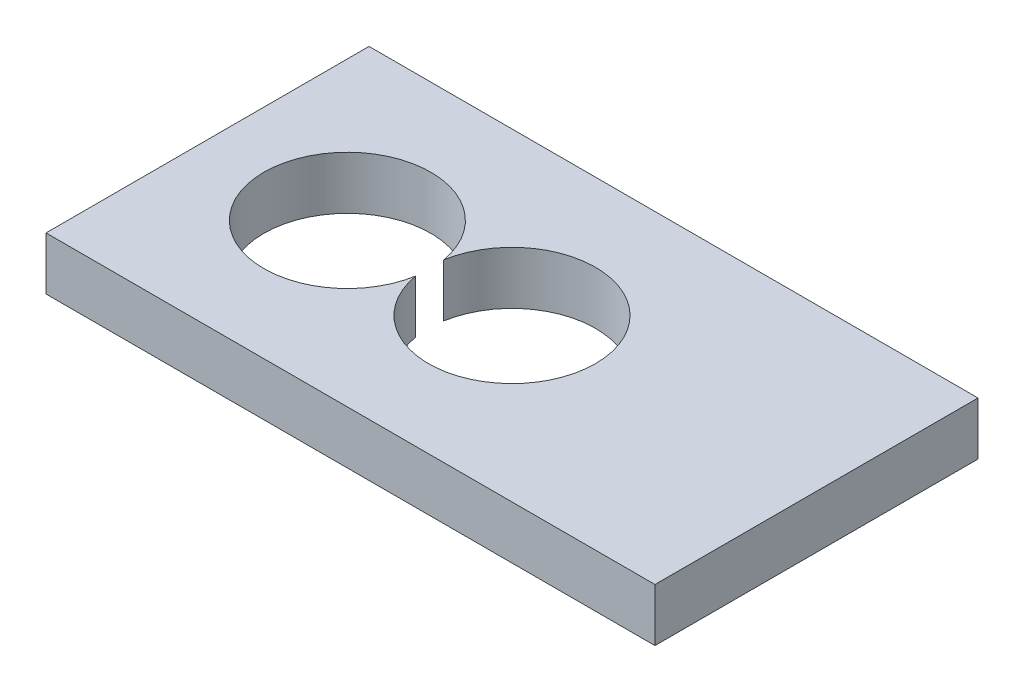
ISO-10303-21;
HEADER;
FILE_DESCRIPTION(('STEP AP214'),'2;1');
FILE_NAME('part.step','',(''),(''),'','','');
FILE_SCHEMA(('AUTOMOTIVE_DESIGN { 1 0 10303 214 1 1 1 1 }'));
ENDSEC;
DATA;
#1=APPLICATION_CONTEXT('core data for automotive mechanical design processes');
#2=APPLICATION_PROTOCOL_DEFINITION('international standard','automotive_design',2000,#1);
#3=PRODUCT_CONTEXT('',#1,'mechanical');
#4=PRODUCT('Part','Part','',(#3));
#5=PRODUCT_RELATED_PRODUCT_CATEGORY('part','',(#4));
#6=PRODUCT_DEFINITION_FORMATION('','',#4);
#7=PRODUCT_DEFINITION_CONTEXT('part definition',#1,'design');
#8=PRODUCT_DEFINITION('design','',#6,#7);
#9=PRODUCT_DEFINITION_SHAPE('','',#8);
#10=(LENGTH_UNIT() NAMED_UNIT(*) SI_UNIT(.MILLI.,.METRE.));
#11=(NAMED_UNIT(*) PLANE_ANGLE_UNIT() SI_UNIT($,.RADIAN.));
#12=(NAMED_UNIT(*) SI_UNIT($,.STERADIAN.) SOLID_ANGLE_UNIT());
#13=UNCERTAINTY_MEASURE_WITH_UNIT(LENGTH_MEASURE(1.E-05),#10,'distance_accuracy_value','');
#14=(GEOMETRIC_REPRESENTATION_CONTEXT(3) GLOBAL_UNCERTAINTY_ASSIGNED_CONTEXT((#13)) GLOBAL_UNIT_ASSIGNED_CONTEXT((#10,
#11,#12)) REPRESENTATION_CONTEXT('',''));
#15=CARTESIAN_POINT('',(0.,0.,0.));
#16=DIRECTION('',(0.,0.,1.));
#17=DIRECTION('',(1.,0.,0.));
#18=AXIS2_PLACEMENT_3D('',#15,#16,#17);
#19=CARTESIAN_POINT('',(25.8927295140813,-4.5,-13.7351534541663));
#20=DIRECTION('',(1.,0.,0.));
#21=DIRECTION('',(0.,0.,-1.));
#22=AXIS2_PLACEMENT_3D('',#19,#20,#21);
#23=PLANE('',#22);
#24=DIRECTION('',(0.,0.,-1.));
#25=VECTOR('',#24,1.);
#26=CARTESIAN_POINT('',(25.8927295140813,0.,-13.7351534541663));
#27=LINE('',#26,#25);
#28=CARTESIAN_POINT('',(25.8927295140813,0.,13.7351534541663));
#29=VERTEX_POINT('',#28);
#30=CARTESIAN_POINT('',(25.8927295140813,0.,-13.7351534541663));
#31=VERTEX_POINT('',#30);
#32=EDGE_CURVE('E119',#29,#31,#27,.T.);
#33=ORIENTED_EDGE('',*,*,#32,.F.);
#34=DIRECTION('',(0.,1.,0.));
#35=VECTOR('',#34,1.);
#36=CARTESIAN_POINT('',(25.8927295140813,-4.5,13.7351534541663));
#37=LINE('',#36,#35);
#38=CARTESIAN_POINT('',(25.8927295140813,-4.5,13.7351534541663));
#39=VERTEX_POINT('',#38);
#40=EDGE_CURVE('E11',#39,#29,#37,.T.);
#41=ORIENTED_EDGE('',*,*,#40,.F.);
#42=DIRECTION('',(0.,0.,-1.));
#43=VECTOR('',#42,1.);
#44=CARTESIAN_POINT('',(25.8927295140813,-4.5,-13.7351534541663));
#45=LINE('',#44,#43);
#46=CARTESIAN_POINT('',(25.8927295140813,-4.5,-13.7351534541663));
#47=VERTEX_POINT('',#46);
#48=EDGE_CURVE('E121',#39,#47,#45,.T.);
#49=ORIENTED_EDGE('',*,*,#48,.T.);
#50=DIRECTION('',(0.,1.,0.));
#51=VECTOR('',#50,1.);
#52=CARTESIAN_POINT('',(25.8927295140813,-4.5,-13.7351534541663));
#53=LINE('',#52,#51);
#54=EDGE_CURVE('E46',#47,#31,#53,.T.);
#55=ORIENTED_EDGE('',*,*,#54,.T.);
#56=EDGE_LOOP('',(#33,#41,#49,#55));
#57=FACE_BOUND('',#56,.T.);
#58=ADVANCED_FACE('F43',(#57),#23,.T.);
#59=CARTESIAN_POINT('',(-25.8927295140813,-4.5,13.7351534541663));
#60=DIRECTION('',(0.,0.,1.));
#61=DIRECTION('',(1.,0.,0.));
#62=AXIS2_PLACEMENT_3D('',#59,#60,#61);
#63=PLANE('',#62);
#64=DIRECTION('',(1.,0.,0.));
#65=VECTOR('',#64,1.);
#66=CARTESIAN_POINT('',(-25.8927295140813,0.,13.7351534541663));
#67=LINE('',#66,#65);
#68=CARTESIAN_POINT('',(-25.8927295140813,0.,13.7351534541663));
#69=VERTEX_POINT('',#68);
#70=EDGE_CURVE('E126',#69,#29,#67,.T.);
#71=ORIENTED_EDGE('',*,*,#70,.F.);
#72=DIRECTION('',(0.,1.,0.));
#73=VECTOR('',#72,1.);
#74=CARTESIAN_POINT('',(-25.8927295140813,-4.5,13.7351534541663));
#75=LINE('',#74,#73);
#76=CARTESIAN_POINT('',(-25.8927295140813,-4.5,13.7351534541663));
#77=VERTEX_POINT('',#76);
#78=EDGE_CURVE('E52',#77,#69,#75,.T.);
#79=ORIENTED_EDGE('',*,*,#78,.F.);
#80=DIRECTION('',(1.,0.,0.));
#81=VECTOR('',#80,1.);
#82=CARTESIAN_POINT('',(-25.8927295140813,-4.5,13.7351534541663));
#83=LINE('',#82,#81);
#84=EDGE_CURVE('E134',#77,#39,#83,.T.);
#85=ORIENTED_EDGE('',*,*,#84,.T.);
#86=ORIENTED_EDGE('',*,*,#40,.T.);
#87=EDGE_LOOP('',(#71,#79,#85,#86));
#88=FACE_BOUND('',#87,.T.);
#89=ADVANCED_FACE('F168',(#88),#63,.T.);
#90=CARTESIAN_POINT('',(-25.8927295140813,-4.5,-13.7351534541663));
#91=DIRECTION('',(-1.,0.,0.));
#92=DIRECTION('',(0.,0.,1.));
#93=AXIS2_PLACEMENT_3D('',#90,#91,#92);
#94=PLANE('',#93);
#95=DIRECTION('',(0.,0.,1.));
#96=VECTOR('',#95,1.);
#97=CARTESIAN_POINT('',(-25.8927295140813,0.,-13.7351534541663));
#98=LINE('',#97,#96);
#99=CARTESIAN_POINT('',(-25.8927295140813,0.,-13.7351534541663));
#100=VERTEX_POINT('',#99);
#101=EDGE_CURVE('E145',#100,#69,#98,.T.);
#102=ORIENTED_EDGE('',*,*,#101,.F.);
#103=DIRECTION('',(0.,1.,0.));
#104=VECTOR('',#103,1.);
#105=CARTESIAN_POINT('',(-25.8927295140813,-4.5,-13.7351534541663));
#106=LINE('',#105,#104);
#107=CARTESIAN_POINT('',(-25.8927295140813,-4.5,-13.7351534541663));
#108=VERTEX_POINT('',#107);
#109=EDGE_CURVE('E153',#108,#100,#106,.T.);
#110=ORIENTED_EDGE('',*,*,#109,.F.);
#111=DIRECTION('',(0.,0.,1.));
#112=VECTOR('',#111,1.);
#113=CARTESIAN_POINT('',(-25.8927295140813,-4.5,-13.7351534541663));
#114=LINE('',#113,#112);
#115=EDGE_CURVE('E130',#108,#77,#114,.T.);
#116=ORIENTED_EDGE('',*,*,#115,.T.);
#117=ORIENTED_EDGE('',*,*,#78,.T.);
#118=EDGE_LOOP('',(#102,#110,#116,#117));
#119=FACE_BOUND('',#118,.T.);
#120=ADVANCED_FACE('F172',(#119),#94,.T.);
#121=CARTESIAN_POINT('',(-25.8927295140813,-4.5,-13.7351534541663));
#122=DIRECTION('',(0.,0.,-1.));
#123=DIRECTION('',(-1.,0.,0.));
#124=AXIS2_PLACEMENT_3D('',#121,#122,#123);
#125=PLANE('',#124);
#126=DIRECTION('',(-1.,0.,0.));
#127=VECTOR('',#126,1.);
#128=CARTESIAN_POINT('',(-25.8927295140813,0.,-13.7351534541663));
#129=LINE('',#128,#127);
#130=EDGE_CURVE('E141',#31,#100,#129,.T.);
#131=ORIENTED_EDGE('',*,*,#130,.F.);
#132=ORIENTED_EDGE('',*,*,#54,.F.);
#133=DIRECTION('',(-1.,0.,0.));
#134=VECTOR('',#133,1.);
#135=CARTESIAN_POINT('',(-25.8927295140813,-4.5,-13.7351534541663));
#136=LINE('',#135,#134);
#137=EDGE_CURVE('E125',#47,#108,#136,.T.);
#138=ORIENTED_EDGE('',*,*,#137,.T.);
#139=ORIENTED_EDGE('',*,*,#109,.T.);
#140=EDGE_LOOP('',(#131,#132,#138,#139));
#141=FACE_BOUND('',#140,.T.);
#142=ADVANCED_FACE('F163',(#141),#125,.T.);
#143=CARTESIAN_POINT('',(0.,-4.5,0.));
#144=DIRECTION('',(0.,1.,0.));
#145=DIRECTION('',(0.,0.,1.));
#146=AXIS2_PLACEMENT_3D('',#143,#144,#145);
#147=PLANE('',#146);
#148=CARTESIAN_POINT('',(-14.,-4.5,0.));
#149=DIRECTION('',(0.,1.,0.));
#150=DIRECTION('',(0.,0.,1.));
#151=AXIS2_PLACEMENT_3D('',#148,#149,#150);
#152=CIRCLE('',#151,7.1);
#153=CARTESIAN_POINT('',(-7.,-4.5,-1.18743420870379));
#154=VERTEX_POINT('',#153);
#155=CARTESIAN_POINT('',(-7.,-4.5,1.18743420870379));
#156=VERTEX_POINT('',#155);
#157=EDGE_CURVE('E101',#154,#156,#152,.T.);
#158=ORIENTED_EDGE('',*,*,#157,.T.);
#159=CARTESIAN_POINT('',(0.,-4.5,0.));
#160=DIRECTION('',(0.,1.,0.));
#161=DIRECTION('',(0.,0.,1.));
#162=AXIS2_PLACEMENT_3D('',#159,#160,#161);
#163=CIRCLE('',#162,7.1);
#164=EDGE_CURVE('E60',#156,#154,#163,.T.);
#165=ORIENTED_EDGE('',*,*,#164,.T.);
#166=EDGE_LOOP('',(#158,#165));
#167=FACE_BOUND('',#166,.T.);
#168=ORIENTED_EDGE('',*,*,#48,.F.);
#169=ORIENTED_EDGE('',*,*,#84,.F.);
#170=ORIENTED_EDGE('',*,*,#115,.F.);
#171=ORIENTED_EDGE('',*,*,#137,.F.);
#172=EDGE_LOOP('',(#168,#169,#170,#171));
#173=FACE_BOUND('',#172,.T.);
#174=ADVANCED_FACE('F108',(#167,#173),#147,.F.);
#175=CARTESIAN_POINT('',(0.,0.,0.));
#176=DIRECTION('',(0.,1.,0.));
#177=DIRECTION('',(0.,0.,1.));
#178=AXIS2_PLACEMENT_3D('',#175,#176,#177);
#179=PLANE('',#178);
#180=CARTESIAN_POINT('',(0.,0.,0.));
#181=DIRECTION('',(0.,1.,0.));
#182=DIRECTION('',(0.,0.,1.));
#183=AXIS2_PLACEMENT_3D('',#180,#181,#182);
#184=CIRCLE('',#183,7.1);
#185=CARTESIAN_POINT('',(-7.,0.,1.18743420870379));
#186=VERTEX_POINT('',#185);
#187=CARTESIAN_POINT('',(-7.,0.,-1.18743420870379));
#188=VERTEX_POINT('',#187);
#189=EDGE_CURVE('E65',#186,#188,#184,.T.);
#190=ORIENTED_EDGE('',*,*,#189,.F.);
#191=CARTESIAN_POINT('',(-14.,0.,0.));
#192=DIRECTION('',(0.,1.,0.));
#193=DIRECTION('',(0.,0.,1.));
#194=AXIS2_PLACEMENT_3D('',#191,#192,#193);
#195=CIRCLE('',#194,7.1);
#196=EDGE_CURVE('E111',#188,#186,#195,.T.);
#197=ORIENTED_EDGE('',*,*,#196,.F.);
#198=EDGE_LOOP('',(#190,#197));
#199=FACE_BOUND('',#198,.T.);
#200=ORIENTED_EDGE('',*,*,#32,.T.);
#201=ORIENTED_EDGE('',*,*,#130,.T.);
#202=ORIENTED_EDGE('',*,*,#101,.T.);
#203=ORIENTED_EDGE('',*,*,#70,.T.);
#204=EDGE_LOOP('',(#200,#201,#202,#203));
#205=FACE_BOUND('',#204,.T.);
#206=ADVANCED_FACE('F165',(#199,#205),#179,.T.);
#207=CARTESIAN_POINT('',(0.,-4.5,0.));
#208=DIRECTION('',(0.,1.,0.));
#209=DIRECTION('',(0.,0.,1.));
#210=AXIS2_PLACEMENT_3D('',#207,#208,#209);
#211=CYLINDRICAL_SURFACE('',#210,7.1);
#212=ORIENTED_EDGE('',*,*,#189,.T.);
#213=DIRECTION('',(0.,1.,0.));
#214=VECTOR('',#213,1.);
#215=CARTESIAN_POINT('',(-7.,-4.5,-1.18743420870379));
#216=LINE('',#215,#214);
#217=EDGE_CURVE('E93',#154,#188,#216,.T.);
#218=ORIENTED_EDGE('',*,*,#217,.F.);
#219=ORIENTED_EDGE('',*,*,#164,.F.);
#220=DIRECTION('',(0.,1.,0.));
#221=VECTOR('',#220,1.);
#222=CARTESIAN_POINT('',(-7.,-4.5,1.18743420870379));
#223=LINE('',#222,#221);
#224=EDGE_CURVE('E100',#156,#186,#223,.T.);
#225=ORIENTED_EDGE('',*,*,#224,.T.);
#226=EDGE_LOOP('',(#212,#218,#219,#225));
#227=FACE_BOUND('',#226,.T.);
#228=ADVANCED_FACE('F95',(#227),#211,.F.);
#229=CARTESIAN_POINT('',(-14.,-4.5,0.));
#230=DIRECTION('',(0.,1.,0.));
#231=DIRECTION('',(0.,0.,1.));
#232=AXIS2_PLACEMENT_3D('',#229,#230,#231);
#233=CYLINDRICAL_SURFACE('',#232,7.1);
#234=ORIENTED_EDGE('',*,*,#196,.T.);
#235=ORIENTED_EDGE('',*,*,#224,.F.);
#236=ORIENTED_EDGE('',*,*,#157,.F.);
#237=ORIENTED_EDGE('',*,*,#217,.T.);
#238=EDGE_LOOP('',(#234,#235,#236,#237));
#239=FACE_BOUND('',#238,.T.);
#240=ADVANCED_FACE('F104',(#239),#233,.F.);
#241=CLOSED_SHELL('',(#58,#89,#120,#142,#174,#206,#228,#240));
#242=MANIFOLD_SOLID_BREP('B2',#241);
#243=ADVANCED_BREP_SHAPE_REPRESENTATION('',(#18,#242),#14);
#244=SHAPE_DEFINITION_REPRESENTATION(#9,#243);
ENDSEC;
END-ISO-10303-21;
